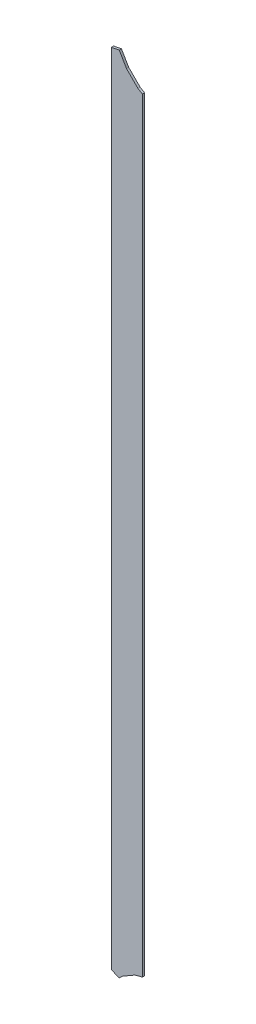
ISO-10303-21;
HEADER;
FILE_DESCRIPTION(('STEP AP214'),'2;1');
FILE_NAME('part.step','',(''),(''),'','','');
FILE_SCHEMA(('AUTOMOTIVE_DESIGN { 1 0 10303 214 1 1 1 1 }'));
ENDSEC;
DATA;
#1=APPLICATION_CONTEXT('core data for automotive mechanical design processes');
#2=APPLICATION_PROTOCOL_DEFINITION('international standard','automotive_design',2000,#1);
#3=PRODUCT_CONTEXT('',#1,'mechanical');
#4=PRODUCT('Part','Part','',(#3));
#5=PRODUCT_RELATED_PRODUCT_CATEGORY('part','',(#4));
#6=PRODUCT_DEFINITION_FORMATION('','',#4);
#7=PRODUCT_DEFINITION_CONTEXT('part definition',#1,'design');
#8=PRODUCT_DEFINITION('design','',#6,#7);
#9=PRODUCT_DEFINITION_SHAPE('','',#8);
#10=(LENGTH_UNIT() NAMED_UNIT(*) SI_UNIT(.MILLI.,.METRE.));
#11=(NAMED_UNIT(*) PLANE_ANGLE_UNIT() SI_UNIT($,.RADIAN.));
#12=(NAMED_UNIT(*) SI_UNIT($,.STERADIAN.) SOLID_ANGLE_UNIT());
#13=UNCERTAINTY_MEASURE_WITH_UNIT(LENGTH_MEASURE(1.E-05),#10,'distance_accuracy_value','');
#14=(GEOMETRIC_REPRESENTATION_CONTEXT(3) GLOBAL_UNCERTAINTY_ASSIGNED_CONTEXT((#13)) GLOBAL_UNIT_ASSIGNED_CONTEXT((#10,
#11,#12)) REPRESENTATION_CONTEXT('',''));
#15=CARTESIAN_POINT('',(0.,0.,0.));
#16=DIRECTION('',(0.,0.,1.));
#17=DIRECTION('',(1.,0.,0.));
#18=AXIS2_PLACEMENT_3D('',#15,#16,#17);
#19=CARTESIAN_POINT('',(88.0250015258789,87.1760025024414,0.));
#20=DIRECTION('',(0.193156749099946,-0.981167911357246,0.));
#21=DIRECTION('',(-0.981167911357246,-0.193156749099946,0.));
#22=AXIS2_PLACEMENT_3D('',#19,#20,#21);
#23=PLANE('',#22);
#24=DIRECTION('',(-0.981167911357246,-0.193156749099946,0.));
#25=VECTOR('',#24,1.);
#26=CARTESIAN_POINT('',(88.0250015258789,87.1760025024414,0.03556));
#27=LINE('',#26,#25);
#28=CARTESIAN_POINT('',(88.0250015258789,87.1760025024414,0.03556));
#29=VERTEX_POINT('',#28);
#30=CARTESIAN_POINT('',(87.8980026245117,87.1510009765625,0.03556));
#31=VERTEX_POINT('',#30);
#32=EDGE_CURVE('E11',#29,#31,#27,.T.);
#33=ORIENTED_EDGE('',*,*,#32,.F.);
#34=DIRECTION('',(0.,0.,1.));
#35=VECTOR('',#34,1.);
#36=CARTESIAN_POINT('',(88.0250015258789,87.1760025024414,0.));
#37=LINE('',#36,#35);
#38=CARTESIAN_POINT('',(88.0250015258789,87.1760025024414,0.));
#39=VERTEX_POINT('',#38);
#40=EDGE_CURVE('E24',#39,#29,#37,.T.);
#41=ORIENTED_EDGE('',*,*,#40,.F.);
#42=DIRECTION('',(-0.981167911357246,-0.193156749099946,0.));
#43=VECTOR('',#42,1.);
#44=CARTESIAN_POINT('',(88.0250015258789,87.1760025024414,0.));
#45=LINE('',#44,#43);
#46=CARTESIAN_POINT('',(87.8980026245117,87.1510009765625,0.));
#47=VERTEX_POINT('',#46);
#48=EDGE_CURVE('E112',#39,#47,#45,.T.);
#49=ORIENTED_EDGE('',*,*,#48,.T.);
#50=DIRECTION('',(0.,0.,1.));
#51=VECTOR('',#50,1.);
#52=CARTESIAN_POINT('',(87.8980026245117,87.1510009765625,0.));
#53=LINE('',#52,#51);
#54=EDGE_CURVE('E37',#47,#31,#53,.T.);
#55=ORIENTED_EDGE('',*,*,#54,.T.);
#56=EDGE_LOOP('',(#33,#41,#49,#55));
#57=FACE_BOUND('',#56,.T.);
#58=ADVANCED_FACE('F17',(#57),#23,.F.);
#59=CARTESIAN_POINT('',(87.8980026245117,87.1510009765625,0.));
#60=DIRECTION('',(1.,0.,0.));
#61=DIRECTION('',(0.,-1.,0.));
#62=AXIS2_PLACEMENT_3D('',#59,#60,#61);
#63=PLANE('',#62);
#64=DIRECTION('',(0.,-1.,0.));
#65=VECTOR('',#64,1.);
#66=CARTESIAN_POINT('',(87.8980026245117,87.1510009765625,0.03556));
#67=LINE('',#66,#65);
#68=CARTESIAN_POINT('',(87.8980026245117,74.2919998168945,0.03556));
#69=VERTEX_POINT('',#68);
#70=EDGE_CURVE('E168',#31,#69,#67,.T.);
#71=ORIENTED_EDGE('',*,*,#70,.F.);
#72=ORIENTED_EDGE('',*,*,#54,.F.);
#73=DIRECTION('',(0.,-1.,0.));
#74=VECTOR('',#73,1.);
#75=CARTESIAN_POINT('',(87.8980026245117,87.1510009765625,0.));
#76=LINE('',#75,#74);
#77=CARTESIAN_POINT('',(87.8980026245117,74.2919998168945,0.));
#78=VERTEX_POINT('',#77);
#79=EDGE_CURVE('E165',#47,#78,#76,.T.);
#80=ORIENTED_EDGE('',*,*,#79,.T.);
#81=DIRECTION('',(0.,0.,1.));
#82=VECTOR('',#81,1.);
#83=CARTESIAN_POINT('',(87.8980026245117,74.2919998168945,0.));
#84=LINE('',#83,#82);
#85=EDGE_CURVE('E163',#78,#69,#84,.T.);
#86=ORIENTED_EDGE('',*,*,#85,.T.);
#87=EDGE_LOOP('',(#71,#72,#80,#86));
#88=FACE_BOUND('',#87,.T.);
#89=ADVANCED_FACE('F176',(#88),#63,.F.);
#90=CARTESIAN_POINT('',(87.8980026245117,74.2919998168945,0.));
#91=DIRECTION('',(0.378931559902647,0.925424698670695,0.));
#92=DIRECTION('',(0.925424698670695,-0.378931559902647,0.));
#93=AXIS2_PLACEMENT_3D('',#90,#91,#92);
#94=PLANE('',#93);
#95=DIRECTION('',(0.925424698670695,-0.378931559902647,0.));
#96=VECTOR('',#95,1.);
#97=CARTESIAN_POINT('',(87.8980026245117,74.2919998168945,0.03556));
#98=LINE('',#97,#96);
#99=CARTESIAN_POINT('',(88.0250015258789,74.2399978637695,0.03556));
#100=VERTEX_POINT('',#99);
#101=EDGE_CURVE('E160',#69,#100,#98,.T.);
#102=ORIENTED_EDGE('',*,*,#101,.F.);
#103=ORIENTED_EDGE('',*,*,#85,.F.);
#104=DIRECTION('',(0.925424698670695,-0.378931559902647,0.));
#105=VECTOR('',#104,1.);
#106=CARTESIAN_POINT('',(87.8980026245117,74.2919998168945,0.));
#107=LINE('',#106,#105);
#108=CARTESIAN_POINT('',(88.0250015258789,74.2399978637695,0.));
#109=VERTEX_POINT('',#108);
#110=EDGE_CURVE('E157',#78,#109,#107,.T.);
#111=ORIENTED_EDGE('',*,*,#110,.T.);
#112=DIRECTION('',(0.,0.,1.));
#113=VECTOR('',#112,1.);
#114=CARTESIAN_POINT('',(88.0250015258789,74.2399978637695,0.));
#115=LINE('',#114,#113);
#116=EDGE_CURVE('E155',#109,#100,#115,.T.);
#117=ORIENTED_EDGE('',*,*,#116,.T.);
#118=EDGE_LOOP('',(#102,#103,#111,#117));
#119=FACE_BOUND('',#118,.T.);
#120=ADVANCED_FACE('F182',(#119),#94,.F.);
#121=CARTESIAN_POINT('',(88.0250015258789,74.2399978637695,0.));
#122=DIRECTION('',(-0.700212773709357,0.713934220733429,0.));
#123=DIRECTION('',(0.713934220733429,0.700212773709357,0.));
#124=AXIS2_PLACEMENT_3D('',#121,#122,#123);
#125=PLANE('',#124);
#126=DIRECTION('',(0.713934220733429,0.700212773709357,0.));
#127=VECTOR('',#126,1.);
#128=CARTESIAN_POINT('',(88.0250015258789,74.2399978637695,0.03556));
#129=LINE('',#128,#127);
#130=CARTESIAN_POINT('',(88.0770034790039,74.2910003662109,0.03556));
#131=VERTEX_POINT('',#130);
#132=EDGE_CURVE('E152',#100,#131,#129,.T.);
#133=ORIENTED_EDGE('',*,*,#132,.F.);
#134=ORIENTED_EDGE('',*,*,#116,.F.);
#135=DIRECTION('',(0.713934220733429,0.700212773709357,0.));
#136=VECTOR('',#135,1.);
#137=CARTESIAN_POINT('',(88.0250015258789,74.2399978637695,0.));
#138=LINE('',#137,#136);
#139=CARTESIAN_POINT('',(88.0770034790039,74.2910003662109,0.));
#140=VERTEX_POINT('',#139);
#141=EDGE_CURVE('E149',#109,#140,#138,.T.);
#142=ORIENTED_EDGE('',*,*,#141,.T.);
#143=DIRECTION('',(0.,0.,1.));
#144=VECTOR('',#143,1.);
#145=CARTESIAN_POINT('',(88.0770034790039,74.2910003662109,0.));
#146=LINE('',#145,#144);
#147=EDGE_CURVE('E147',#140,#131,#146,.T.);
#148=ORIENTED_EDGE('',*,*,#147,.T.);
#149=EDGE_LOOP('',(#133,#134,#142,#148));
#150=FACE_BOUND('',#149,.T.);
#151=ADVANCED_FACE('F184',(#150),#125,.F.);
#152=CARTESIAN_POINT('',(88.0770034790039,74.2910003662109,0.));
#153=DIRECTION('',(-0.50171512668388,0.865032907846042,0.));
#154=DIRECTION('',(0.865032907846042,0.50171512668388,0.));
#155=AXIS2_PLACEMENT_3D('',#152,#153,#154);
#156=PLANE('',#155);
#157=DIRECTION('',(0.865032907846042,0.50171512668388,0.));
#158=VECTOR('',#157,1.);
#159=CARTESIAN_POINT('',(88.0770034790039,74.2910003662109,0.03556));
#160=LINE('',#159,#158);
#161=CARTESIAN_POINT('',(88.2770004272461,74.4069976806641,0.03556));
#162=VERTEX_POINT('',#161);
#163=EDGE_CURVE('E144',#131,#162,#160,.T.);
#164=ORIENTED_EDGE('',*,*,#163,.F.);
#165=ORIENTED_EDGE('',*,*,#147,.F.);
#166=DIRECTION('',(0.865032907846042,0.50171512668388,0.));
#167=VECTOR('',#166,1.);
#168=CARTESIAN_POINT('',(88.0770034790039,74.2910003662109,0.));
#169=LINE('',#168,#167);
#170=CARTESIAN_POINT('',(88.2770004272461,74.4069976806641,0.));
#171=VERTEX_POINT('',#170);
#172=EDGE_CURVE('E141',#140,#171,#169,.T.);
#173=ORIENTED_EDGE('',*,*,#172,.T.);
#174=DIRECTION('',(0.,0.,1.));
#175=VECTOR('',#174,1.);
#176=CARTESIAN_POINT('',(88.2770004272461,74.4069976806641,0.));
#177=LINE('',#176,#175);
#178=EDGE_CURVE('E139',#171,#162,#177,.T.);
#179=ORIENTED_EDGE('',*,*,#178,.T.);
#180=EDGE_LOOP('',(#164,#165,#173,#179));
#181=FACE_BOUND('',#180,.T.);
#182=ADVANCED_FACE('F189',(#181),#156,.F.);
#183=CARTESIAN_POINT('',(88.2770004272461,74.4069976806641,0.));
#184=DIRECTION('',(-0.255708260181519,0.966753994393062,0.));
#185=DIRECTION('',(0.966753994393062,0.255708260181519,0.));
#186=AXIS2_PLACEMENT_3D('',#183,#184,#185);
#187=PLANE('',#186);
#188=DIRECTION('',(0.966753994393062,0.255708260181519,0.));
#189=VECTOR('',#188,1.);
#190=CARTESIAN_POINT('',(88.2770004272461,74.4069976806641,0.03556));
#191=LINE('',#190,#189);
#192=CARTESIAN_POINT('',(88.3980026245117,74.4390029907227,0.03556));
#193=VERTEX_POINT('',#192);
#194=EDGE_CURVE('E136',#162,#193,#191,.T.);
#195=ORIENTED_EDGE('',*,*,#194,.F.);
#196=ORIENTED_EDGE('',*,*,#178,.F.);
#197=DIRECTION('',(0.966753994393062,0.255708260181519,0.));
#198=VECTOR('',#197,1.);
#199=CARTESIAN_POINT('',(88.2770004272461,74.4069976806641,0.));
#200=LINE('',#199,#198);
#201=CARTESIAN_POINT('',(88.3980026245117,74.4390029907227,0.));
#202=VERTEX_POINT('',#201);
#203=EDGE_CURVE('E133',#171,#202,#200,.T.);
#204=ORIENTED_EDGE('',*,*,#203,.T.);
#205=DIRECTION('',(0.,0.,1.));
#206=VECTOR('',#205,1.);
#207=CARTESIAN_POINT('',(88.3980026245117,74.4390029907227,0.));
#208=LINE('',#207,#206);
#209=EDGE_CURVE('E131',#202,#193,#208,.T.);
#210=ORIENTED_EDGE('',*,*,#209,.T.);
#211=EDGE_LOOP('',(#195,#196,#204,#210));
#212=FACE_BOUND('',#211,.T.);
#213=ADVANCED_FACE('F192',(#212),#187,.F.);
#214=CARTESIAN_POINT('',(88.3980026245117,74.4390029907227,0.));
#215=DIRECTION('',(-1.,0.,0.));
#216=DIRECTION('',(0.,1.,0.));
#217=AXIS2_PLACEMENT_3D('',#214,#215,#216);
#218=PLANE('',#217);
#219=DIRECTION('',(0.,1.,0.));
#220=VECTOR('',#219,1.);
#221=CARTESIAN_POINT('',(88.3980026245117,74.4390029907227,0.03556));
#222=LINE('',#221,#220);
#223=CARTESIAN_POINT('',(88.3980026245117,86.7490005493164,0.03556));
#224=VERTEX_POINT('',#223);
#225=EDGE_CURVE('E128',#193,#224,#222,.T.);
#226=ORIENTED_EDGE('',*,*,#225,.F.);
#227=ORIENTED_EDGE('',*,*,#209,.F.);
#228=DIRECTION('',(0.,1.,0.));
#229=VECTOR('',#228,1.);
#230=CARTESIAN_POINT('',(88.3980026245117,74.4390029907227,0.));
#231=LINE('',#230,#229);
#232=CARTESIAN_POINT('',(88.3980026245117,86.7490005493164,0.));
#233=VERTEX_POINT('',#232);
#234=EDGE_CURVE('E125',#202,#233,#231,.T.);
#235=ORIENTED_EDGE('',*,*,#234,.T.);
#236=DIRECTION('',(0.,0.,1.));
#237=VECTOR('',#236,1.);
#238=CARTESIAN_POINT('',(88.3980026245117,86.7490005493164,0.));
#239=LINE('',#238,#237);
#240=EDGE_CURVE('E123',#233,#224,#239,.T.);
#241=ORIENTED_EDGE('',*,*,#240,.T.);
#242=EDGE_LOOP('',(#226,#227,#235,#241));
#243=FACE_BOUND('',#242,.T.);
#244=ADVANCED_FACE('F197',(#243),#218,.F.);
#245=CARTESIAN_POINT('',(88.3980026245117,86.7490005493164,0.));
#246=DIRECTION('',(-0.503836881647622,-0.863798817255268,0.));
#247=DIRECTION('',(-0.863798817255268,0.503836881647622,0.));
#248=AXIS2_PLACEMENT_3D('',#245,#246,#247);
#249=PLANE('',#248);
#250=DIRECTION('',(-0.863798817255268,0.503836881647622,0.));
#251=VECTOR('',#250,1.);
#252=CARTESIAN_POINT('',(88.3980026245117,86.7490005493164,0.03556));
#253=LINE('',#252,#251);
#254=CARTESIAN_POINT('',(88.3259963989258,86.7910003662109,0.03556));
#255=VERTEX_POINT('',#254);
#256=EDGE_CURVE('E120',#224,#255,#253,.T.);
#257=ORIENTED_EDGE('',*,*,#256,.F.);
#258=ORIENTED_EDGE('',*,*,#240,.F.);
#259=DIRECTION('',(-0.863798817255268,0.503836881647622,0.));
#260=VECTOR('',#259,1.);
#261=CARTESIAN_POINT('',(88.3980026245117,86.7490005493164,0.));
#262=LINE('',#261,#260);
#263=CARTESIAN_POINT('',(88.3259963989258,86.7910003662109,0.));
#264=VERTEX_POINT('',#263);
#265=EDGE_CURVE('E118',#233,#264,#262,.T.);
#266=ORIENTED_EDGE('',*,*,#265,.T.);
#267=DIRECTION('',(0.,0.,1.));
#268=VECTOR('',#267,1.);
#269=CARTESIAN_POINT('',(88.3259963989258,86.7910003662109,0.));
#270=LINE('',#269,#268);
#271=EDGE_CURVE('E103',#264,#255,#270,.T.);
#272=ORIENTED_EDGE('',*,*,#271,.T.);
#273=EDGE_LOOP('',(#257,#258,#266,#272));
#274=FACE_BOUND('',#273,.T.);
#275=ADVANCED_FACE('F199',(#274),#249,.F.);
#276=CARTESIAN_POINT('',(88.3259963989258,86.7910003662109,0.));
#277=DIRECTION('',(-0.707106781186548,-0.707106781186548,0.));
#278=DIRECTION('',(-0.707106781186548,0.707106781186548,0.));
#279=AXIS2_PLACEMENT_3D('',#276,#277,#278);
#280=PLANE('',#279);
#281=DIRECTION('',(-0.707106781186548,0.707106781186548,0.));
#282=VECTOR('',#281,1.);
#283=CARTESIAN_POINT('',(88.3259963989258,86.7910003662109,0.03556));
#284=LINE('',#283,#282);
#285=CARTESIAN_POINT('',(88.140998840332,86.9759979248047,0.03556));
#286=VERTEX_POINT('',#285);
#287=EDGE_CURVE('E107',#255,#286,#284,.T.);
#288=ORIENTED_EDGE('',*,*,#287,.F.);
#289=ORIENTED_EDGE('',*,*,#271,.F.);
#290=DIRECTION('',(-0.707106781186548,0.707106781186548,0.));
#291=VECTOR('',#290,1.);
#292=CARTESIAN_POINT('',(88.3259963989258,86.7910003662109,0.));
#293=LINE('',#292,#291);
#294=CARTESIAN_POINT('',(88.140998840332,86.9759979248047,0.));
#295=VERTEX_POINT('',#294);
#296=EDGE_CURVE('E99',#264,#295,#293,.T.);
#297=ORIENTED_EDGE('',*,*,#296,.T.);
#298=DIRECTION('',(0.,0.,1.));
#299=VECTOR('',#298,1.);
#300=CARTESIAN_POINT('',(88.140998840332,86.9759979248047,0.));
#301=LINE('',#300,#299);
#302=EDGE_CURVE('E89',#295,#286,#301,.T.);
#303=ORIENTED_EDGE('',*,*,#302,.T.);
#304=EDGE_LOOP('',(#288,#289,#297,#303));
#305=FACE_BOUND('',#304,.T.);
#306=ADVANCED_FACE('F102',(#305),#280,.F.);
#307=CARTESIAN_POINT('',(88.140998840332,86.9759979248047,0.));
#308=DIRECTION('',(-0.865041213907293,-0.501700805502441,0.));
#309=DIRECTION('',(-0.501700805502441,0.865041213907293,0.));
#310=AXIS2_PLACEMENT_3D('',#307,#308,#309);
#311=PLANE('',#310);
#312=DIRECTION('',(-0.501700805502441,0.865041213907293,0.));
#313=VECTOR('',#312,1.);
#314=CARTESIAN_POINT('',(88.140998840332,86.9759979248047,0.03556));
#315=LINE('',#314,#313);
#316=EDGE_CURVE('E95',#286,#29,#315,.T.);
#317=ORIENTED_EDGE('',*,*,#316,.F.);
#318=ORIENTED_EDGE('',*,*,#302,.F.);
#319=DIRECTION('',(-0.501700805502441,0.865041213907293,0.));
#320=VECTOR('',#319,1.);
#321=CARTESIAN_POINT('',(88.140998840332,86.9759979248047,0.));
#322=LINE('',#321,#320);
#323=EDGE_CURVE('E93',#295,#39,#322,.T.);
#324=ORIENTED_EDGE('',*,*,#323,.T.);
#325=ORIENTED_EDGE('',*,*,#40,.T.);
#326=EDGE_LOOP('',(#317,#318,#324,#325));
#327=FACE_BOUND('',#326,.T.);
#328=ADVANCED_FACE('F91',(#327),#311,.F.);
#329=CARTESIAN_POINT('',(88.0250015258789,87.1760025024414,0.));
#330=DIRECTION('',(0.,0.,-1.));
#331=DIRECTION('',(-1.,0.,0.));
#332=AXIS2_PLACEMENT_3D('',#329,#330,#331);
#333=PLANE('',#332);
#334=ORIENTED_EDGE('',*,*,#323,.F.);
#335=ORIENTED_EDGE('',*,*,#296,.F.);
#336=ORIENTED_EDGE('',*,*,#265,.F.);
#337=ORIENTED_EDGE('',*,*,#234,.F.);
#338=ORIENTED_EDGE('',*,*,#203,.F.);
#339=ORIENTED_EDGE('',*,*,#172,.F.);
#340=ORIENTED_EDGE('',*,*,#141,.F.);
#341=ORIENTED_EDGE('',*,*,#110,.F.);
#342=ORIENTED_EDGE('',*,*,#79,.F.);
#343=ORIENTED_EDGE('',*,*,#48,.F.);
#344=EDGE_LOOP('',(#334,#335,#336,#337,#338,#339,#340,#341,#342,#343));
#345=FACE_BOUND('',#344,.T.);
#346=ADVANCED_FACE('F110',(#345),#333,.T.);
#347=CARTESIAN_POINT('',(88.0250015258789,87.1760025024414,0.03556));
#348=DIRECTION('',(0.,0.,-1.));
#349=DIRECTION('',(-1.,0.,0.));
#350=AXIS2_PLACEMENT_3D('',#347,#348,#349);
#351=PLANE('',#350);
#352=ORIENTED_EDGE('',*,*,#32,.T.);
#353=ORIENTED_EDGE('',*,*,#70,.T.);
#354=ORIENTED_EDGE('',*,*,#101,.T.);
#355=ORIENTED_EDGE('',*,*,#132,.T.);
#356=ORIENTED_EDGE('',*,*,#163,.T.);
#357=ORIENTED_EDGE('',*,*,#194,.T.);
#358=ORIENTED_EDGE('',*,*,#225,.T.);
#359=ORIENTED_EDGE('',*,*,#256,.T.);
#360=ORIENTED_EDGE('',*,*,#287,.T.);
#361=ORIENTED_EDGE('',*,*,#316,.T.);
#362=EDGE_LOOP('',(#352,#353,#354,#355,#356,#357,#358,#359,#360,#361));
#363=FACE_BOUND('',#362,.T.);
#364=ADVANCED_FACE('F179',(#363),#351,.F.);
#365=CLOSED_SHELL('',(#58,#89,#120,#151,#182,#213,#244,#275,#306,#328,#346,#364));
#366=MANIFOLD_SOLID_BREP('B1',#365);
#367=ADVANCED_BREP_SHAPE_REPRESENTATION('',(#18,#366),#14);
#368=SHAPE_DEFINITION_REPRESENTATION(#9,#367);
ENDSEC;
END-ISO-10303-21;
